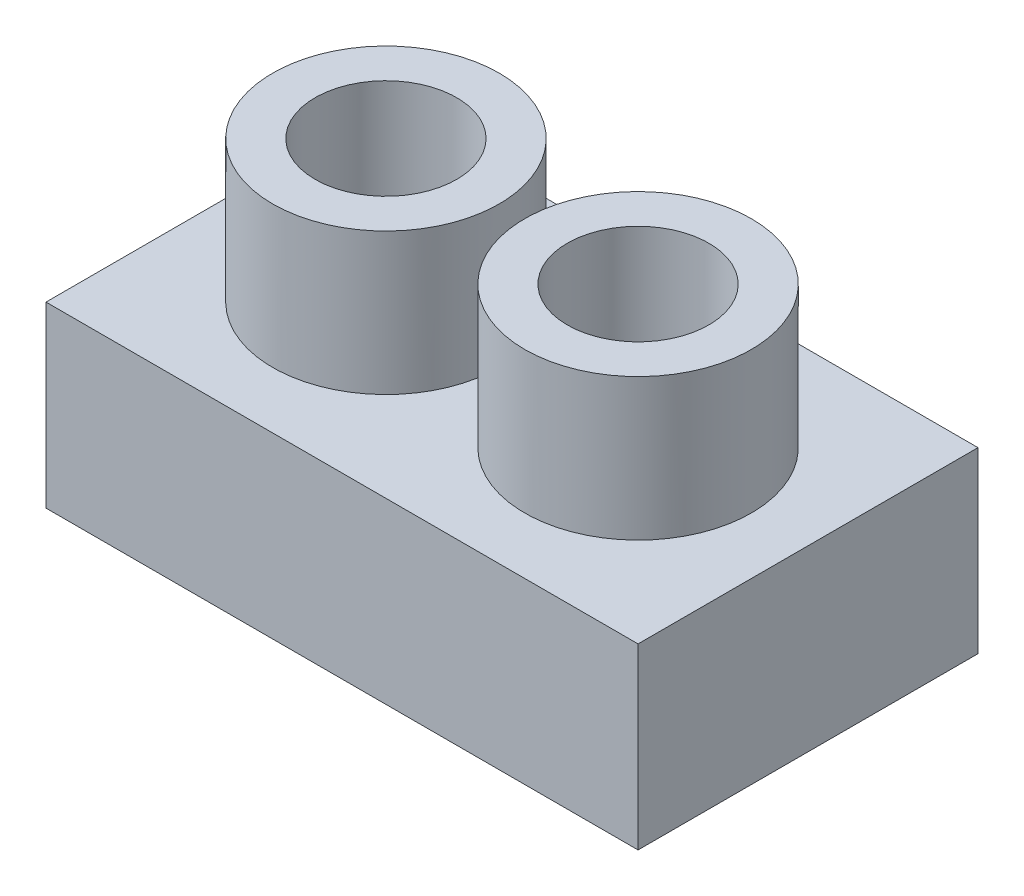
ISO-10303-21;
HEADER;
FILE_DESCRIPTION(('STEP AP214'),'2;1');
FILE_NAME('part.step','',(''),(''),'','','');
FILE_SCHEMA(('AUTOMOTIVE_DESIGN { 1 0 10303 214 1 1 1 1 }'));
ENDSEC;
DATA;
#1=APPLICATION_CONTEXT('core data for automotive mechanical design processes');
#2=APPLICATION_PROTOCOL_DEFINITION('international standard','automotive_design',2000,#1);
#3=PRODUCT_CONTEXT('',#1,'mechanical');
#4=PRODUCT('Part','Part','',(#3));
#5=PRODUCT_RELATED_PRODUCT_CATEGORY('part','',(#4));
#6=PRODUCT_DEFINITION_FORMATION('','',#4);
#7=PRODUCT_DEFINITION_CONTEXT('part definition',#1,'design');
#8=PRODUCT_DEFINITION('design','',#6,#7);
#9=PRODUCT_DEFINITION_SHAPE('','',#8);
#10=(LENGTH_UNIT() NAMED_UNIT(*) SI_UNIT(.MILLI.,.METRE.));
#11=(NAMED_UNIT(*) PLANE_ANGLE_UNIT() SI_UNIT($,.RADIAN.));
#12=(NAMED_UNIT(*) SI_UNIT($,.STERADIAN.) SOLID_ANGLE_UNIT());
#13=UNCERTAINTY_MEASURE_WITH_UNIT(LENGTH_MEASURE(1.E-05),#10,'distance_accuracy_value','');
#14=(GEOMETRIC_REPRESENTATION_CONTEXT(3) GLOBAL_UNCERTAINTY_ASSIGNED_CONTEXT((#13)) GLOBAL_UNIT_ASSIGNED_CONTEXT((#10,
#11,#12)) REPRESENTATION_CONTEXT('',''));
#15=CARTESIAN_POINT('',(0.,0.,0.));
#16=DIRECTION('',(0.,0.,1.));
#17=DIRECTION('',(1.,0.,0.));
#18=AXIS2_PLACEMENT_3D('',#15,#16,#17);
#19=CARTESIAN_POINT('',(0.,6.3,0.));
#20=DIRECTION('',(0.,-1.,0.));
#21=DIRECTION('',(0.,0.,-1.));
#22=AXIS2_PLACEMENT_3D('',#19,#20,#21);
#23=PLANE('',#22);
#24=CARTESIAN_POINT('',(-4.45,6.3,0.));
#25=DIRECTION('',(0.,-1.,0.));
#26=DIRECTION('',(0.,0.,-1.));
#27=AXIS2_PLACEMENT_3D('',#24,#25,#26);
#28=CIRCLE('',#27,4.);
#29=CARTESIAN_POINT('',(-4.45,6.3,-4.));
#30=VERTEX_POINT('',#29);
#31=EDGE_CURVE('E44',#30,#30,#28,.F.);
#32=ORIENTED_EDGE('',*,*,#31,.F.);
#33=EDGE_LOOP('',(#32));
#34=FACE_BOUND('',#33,.T.);
#35=DIRECTION('',(0.,0.,-1.));
#36=VECTOR('',#35,1.);
#37=CARTESIAN_POINT('',(10.45,6.3,6.));
#38=LINE('',#37,#36);
#39=CARTESIAN_POINT('',(10.45,6.3,6.));
#40=VERTEX_POINT('',#39);
#41=CARTESIAN_POINT('',(10.45,6.3,-6.));
#42=VERTEX_POINT('',#41);
#43=EDGE_CURVE('E88',#40,#42,#38,.T.);
#44=ORIENTED_EDGE('',*,*,#43,.T.);
#45=DIRECTION('',(-1.,0.,0.));
#46=VECTOR('',#45,1.);
#47=CARTESIAN_POINT('',(-10.45,6.3,-6.));
#48=LINE('',#47,#46);
#49=CARTESIAN_POINT('',(-10.45,6.3,-6.));
#50=VERTEX_POINT('',#49);
#51=EDGE_CURVE('E83',#42,#50,#48,.T.);
#52=ORIENTED_EDGE('',*,*,#51,.T.);
#53=DIRECTION('',(0.,0.,1.));
#54=VECTOR('',#53,1.);
#55=CARTESIAN_POINT('',(-10.45,6.3,6.));
#56=LINE('',#55,#54);
#57=CARTESIAN_POINT('',(-10.45,6.3,6.));
#58=VERTEX_POINT('',#57);
#59=EDGE_CURVE('E86',#50,#58,#56,.T.);
#60=ORIENTED_EDGE('',*,*,#59,.T.);
#61=DIRECTION('',(1.,0.,0.));
#62=VECTOR('',#61,1.);
#63=CARTESIAN_POINT('',(-10.45,6.3,6.));
#64=LINE('',#63,#62);
#65=EDGE_CURVE('E52',#58,#40,#64,.T.);
#66=ORIENTED_EDGE('',*,*,#65,.T.);
#67=EDGE_LOOP('',(#44,#52,#60,#66));
#68=FACE_BOUND('',#67,.T.);
#69=CARTESIAN_POINT('',(4.45,6.3,0.));
#70=DIRECTION('',(0.,-1.,0.));
#71=DIRECTION('',(0.,0.,-1.));
#72=AXIS2_PLACEMENT_3D('',#69,#70,#71);
#73=CIRCLE('',#72,4.);
#74=CARTESIAN_POINT('',(4.45,6.3,-4.));
#75=VERTEX_POINT('',#74);
#76=EDGE_CURVE('E11',#75,#75,#73,.F.);
#77=ORIENTED_EDGE('',*,*,#76,.F.);
#78=EDGE_LOOP('',(#77));
#79=FACE_BOUND('',#78,.T.);
#80=ADVANCED_FACE('F35',(#34,#68,#79),#23,.F.);
#81=CARTESIAN_POINT('',(10.45,6.3,6.));
#82=DIRECTION('',(-1.,0.,0.));
#83=DIRECTION('',(0.,0.,1.));
#84=AXIS2_PLACEMENT_3D('',#81,#82,#83);
#85=PLANE('',#84);
#86=DIRECTION('',(0.,0.,-1.));
#87=VECTOR('',#86,1.);
#88=CARTESIAN_POINT('',(10.45,0.,6.));
#89=LINE('',#88,#87);
#90=CARTESIAN_POINT('',(10.45,0.,6.));
#91=VERTEX_POINT('',#90);
#92=CARTESIAN_POINT('',(10.45,0.,-6.));
#93=VERTEX_POINT('',#92);
#94=EDGE_CURVE('E103',#91,#93,#89,.T.);
#95=ORIENTED_EDGE('',*,*,#94,.T.);
#96=DIRECTION('',(0.,-1.,0.));
#97=VECTOR('',#96,1.);
#98=CARTESIAN_POINT('',(10.45,6.3,-6.));
#99=LINE('',#98,#97);
#100=EDGE_CURVE('E94',#42,#93,#99,.T.);
#101=ORIENTED_EDGE('',*,*,#100,.F.);
#102=ORIENTED_EDGE('',*,*,#43,.F.);
#103=DIRECTION('',(0.,-1.,0.));
#104=VECTOR('',#103,1.);
#105=CARTESIAN_POINT('',(10.45,6.3,6.));
#106=LINE('',#105,#104);
#107=EDGE_CURVE('E99',#40,#91,#106,.T.);
#108=ORIENTED_EDGE('',*,*,#107,.T.);
#109=EDGE_LOOP('',(#95,#101,#102,#108));
#110=FACE_BOUND('',#109,.T.);
#111=ADVANCED_FACE('F37',(#110),#85,.F.);
#112=CARTESIAN_POINT('',(-10.45,6.3,-6.));
#113=DIRECTION('',(0.,0.,1.));
#114=DIRECTION('',(1.,0.,0.));
#115=AXIS2_PLACEMENT_3D('',#112,#113,#114);
#116=PLANE('',#115);
#117=DIRECTION('',(-1.,0.,0.));
#118=VECTOR('',#117,1.);
#119=CARTESIAN_POINT('',(-10.45,0.,-6.));
#120=LINE('',#119,#118);
#121=CARTESIAN_POINT('',(-10.45,0.,-6.));
#122=VERTEX_POINT('',#121);
#123=EDGE_CURVE('E93',#93,#122,#120,.T.);
#124=ORIENTED_EDGE('',*,*,#123,.T.);
#125=DIRECTION('',(0.,-1.,0.));
#126=VECTOR('',#125,1.);
#127=CARTESIAN_POINT('',(-10.45,6.3,-6.));
#128=LINE('',#127,#126);
#129=EDGE_CURVE('E91',#50,#122,#128,.T.);
#130=ORIENTED_EDGE('',*,*,#129,.F.);
#131=ORIENTED_EDGE('',*,*,#51,.F.);
#132=ORIENTED_EDGE('',*,*,#100,.T.);
#133=EDGE_LOOP('',(#124,#130,#131,#132));
#134=FACE_BOUND('',#133,.T.);
#135=ADVANCED_FACE('F92',(#134),#116,.F.);
#136=CARTESIAN_POINT('',(-10.45,6.3,6.));
#137=DIRECTION('',(1.,0.,0.));
#138=DIRECTION('',(0.,0.,-1.));
#139=AXIS2_PLACEMENT_3D('',#136,#137,#138);
#140=PLANE('',#139);
#141=DIRECTION('',(0.,0.,1.));
#142=VECTOR('',#141,1.);
#143=CARTESIAN_POINT('',(-10.45,0.,6.));
#144=LINE('',#143,#142);
#145=CARTESIAN_POINT('',(-10.45,0.,6.));
#146=VERTEX_POINT('',#145);
#147=EDGE_CURVE('E69',#122,#146,#144,.T.);
#148=ORIENTED_EDGE('',*,*,#147,.T.);
#149=DIRECTION('',(0.,-1.,0.));
#150=VECTOR('',#149,1.);
#151=CARTESIAN_POINT('',(-10.45,6.3,6.));
#152=LINE('',#151,#150);
#153=EDGE_CURVE('E95',#58,#146,#152,.T.);
#154=ORIENTED_EDGE('',*,*,#153,.F.);
#155=ORIENTED_EDGE('',*,*,#59,.F.);
#156=ORIENTED_EDGE('',*,*,#129,.T.);
#157=EDGE_LOOP('',(#148,#154,#155,#156));
#158=FACE_BOUND('',#157,.T.);
#159=ADVANCED_FACE('F97',(#158),#140,.F.);
#160=CARTESIAN_POINT('',(-10.45,6.3,6.));
#161=DIRECTION('',(0.,0.,-1.));
#162=DIRECTION('',(-1.,0.,0.));
#163=AXIS2_PLACEMENT_3D('',#160,#161,#162);
#164=PLANE('',#163);
#165=DIRECTION('',(1.,0.,0.));
#166=VECTOR('',#165,1.);
#167=CARTESIAN_POINT('',(-10.45,0.,6.));
#168=LINE('',#167,#166);
#169=EDGE_CURVE('E75',#146,#91,#168,.T.);
#170=ORIENTED_EDGE('',*,*,#169,.T.);
#171=ORIENTED_EDGE('',*,*,#107,.F.);
#172=ORIENTED_EDGE('',*,*,#65,.F.);
#173=ORIENTED_EDGE('',*,*,#153,.T.);
#174=EDGE_LOOP('',(#170,#171,#172,#173));
#175=FACE_BOUND('',#174,.T.);
#176=ADVANCED_FACE('F129',(#175),#164,.F.);
#177=CARTESIAN_POINT('',(0.,0.,0.));
#178=DIRECTION('',(0.,-1.,0.));
#179=DIRECTION('',(0.,0.,-1.));
#180=AXIS2_PLACEMENT_3D('',#177,#178,#179);
#181=PLANE('',#180);
#182=CARTESIAN_POINT('',(4.45,0.,0.));
#183=DIRECTION('',(0.,-1.,0.));
#184=DIRECTION('',(0.,0.,-1.));
#185=AXIS2_PLACEMENT_3D('',#182,#183,#184);
#186=CIRCLE('',#185,2.5);
#187=CARTESIAN_POINT('',(4.45,0.,-2.5));
#188=VERTEX_POINT('',#187);
#189=EDGE_CURVE('E232',#188,#188,#186,.F.);
#190=ORIENTED_EDGE('',*,*,#189,.T.);
#191=EDGE_LOOP('',(#190));
#192=FACE_BOUND('',#191,.T.);
#193=CARTESIAN_POINT('',(-4.45,0.,0.));
#194=DIRECTION('',(0.,-1.,0.));
#195=DIRECTION('',(0.,0.,-1.));
#196=AXIS2_PLACEMENT_3D('',#193,#194,#195);
#197=CIRCLE('',#196,2.5);
#198=CARTESIAN_POINT('',(-4.45,0.,-2.5));
#199=VERTEX_POINT('',#198);
#200=EDGE_CURVE('E236',#199,#199,#197,.F.);
#201=ORIENTED_EDGE('',*,*,#200,.T.);
#202=EDGE_LOOP('',(#201));
#203=FACE_BOUND('',#202,.T.);
#204=ORIENTED_EDGE('',*,*,#94,.F.);
#205=ORIENTED_EDGE('',*,*,#169,.F.);
#206=ORIENTED_EDGE('',*,*,#147,.F.);
#207=ORIENTED_EDGE('',*,*,#123,.F.);
#208=EDGE_LOOP('',(#204,#205,#206,#207));
#209=FACE_BOUND('',#208,.T.);
#210=ADVANCED_FACE('F126',(#192,#203,#209),#181,.T.);
#211=CARTESIAN_POINT('',(-4.45,11.3,0.));
#212=DIRECTION('',(0.,-1.,0.));
#213=DIRECTION('',(0.,0.,-1.));
#214=AXIS2_PLACEMENT_3D('',#211,#212,#213);
#215=CYLINDRICAL_SURFACE('',#214,4.);
#216=CARTESIAN_POINT('',(-4.45,11.3,0.));
#217=DIRECTION('',(0.,1.,0.));
#218=DIRECTION('',(0.,0.,1.));
#219=AXIS2_PLACEMENT_3D('',#216,#217,#218);
#220=CIRCLE('',#219,4.);
#221=CARTESIAN_POINT('',(-4.45,11.3,4.));
#222=VERTEX_POINT('',#221);
#223=EDGE_CURVE('E106',#222,#222,#220,.T.);
#224=ORIENTED_EDGE('',*,*,#223,.F.);
#225=EDGE_LOOP('',(#224));
#226=FACE_BOUND('',#225,.T.);
#227=ORIENTED_EDGE('',*,*,#31,.T.);
#228=EDGE_LOOP('',(#227));
#229=FACE_BOUND('',#228,.T.);
#230=ADVANCED_FACE('F115',(#226,#229),#215,.T.);
#231=CARTESIAN_POINT('',(-4.45,11.3,0.));
#232=DIRECTION('',(0.,1.,0.));
#233=DIRECTION('',(0.,0.,1.));
#234=AXIS2_PLACEMENT_3D('',#231,#232,#233);
#235=PLANE('',#234);
#236=CARTESIAN_POINT('',(-4.45,11.3,0.));
#237=DIRECTION('',(0.,1.,0.));
#238=DIRECTION('',(0.,0.,1.));
#239=AXIS2_PLACEMENT_3D('',#236,#237,#238);
#240=CIRCLE('',#239,2.5);
#241=CARTESIAN_POINT('',(-4.45,11.3,2.5));
#242=VERTEX_POINT('',#241);
#243=EDGE_CURVE('E233',#242,#242,#240,.T.);
#244=ORIENTED_EDGE('',*,*,#243,.F.);
#245=EDGE_LOOP('',(#244));
#246=FACE_BOUND('',#245,.T.);
#247=ORIENTED_EDGE('',*,*,#223,.T.);
#248=EDGE_LOOP('',(#247));
#249=FACE_BOUND('',#248,.T.);
#250=ADVANCED_FACE('F159',(#246,#249),#235,.T.);
#251=CARTESIAN_POINT('',(4.45,11.3,0.));
#252=DIRECTION('',(0.,-1.,0.));
#253=DIRECTION('',(0.,0.,-1.));
#254=AXIS2_PLACEMENT_3D('',#251,#252,#253);
#255=CYLINDRICAL_SURFACE('',#254,4.);
#256=CARTESIAN_POINT('',(4.45,11.3,0.));
#257=DIRECTION('',(0.,1.,0.));
#258=DIRECTION('',(0.,0.,1.));
#259=AXIS2_PLACEMENT_3D('',#256,#257,#258);
#260=CIRCLE('',#259,4.);
#261=CARTESIAN_POINT('',(4.45,11.3,4.));
#262=VERTEX_POINT('',#261);
#263=EDGE_CURVE('E242',#262,#262,#260,.T.);
#264=ORIENTED_EDGE('',*,*,#263,.F.);
#265=EDGE_LOOP('',(#264));
#266=FACE_BOUND('',#265,.T.);
#267=ORIENTED_EDGE('',*,*,#76,.T.);
#268=EDGE_LOOP('',(#267));
#269=FACE_BOUND('',#268,.T.);
#270=ADVANCED_FACE('F165',(#266,#269),#255,.T.);
#271=CARTESIAN_POINT('',(4.45,11.3,0.));
#272=DIRECTION('',(0.,1.,0.));
#273=DIRECTION('',(0.,0.,1.));
#274=AXIS2_PLACEMENT_3D('',#271,#272,#273);
#275=PLANE('',#274);
#276=CARTESIAN_POINT('',(4.45,11.3,0.));
#277=DIRECTION('',(0.,1.,0.));
#278=DIRECTION('',(0.,0.,1.));
#279=AXIS2_PLACEMENT_3D('',#276,#277,#278);
#280=CIRCLE('',#279,2.5);
#281=CARTESIAN_POINT('',(4.45,11.3,2.5));
#282=VERTEX_POINT('',#281);
#283=EDGE_CURVE('E229',#282,#282,#280,.T.);
#284=ORIENTED_EDGE('',*,*,#283,.F.);
#285=EDGE_LOOP('',(#284));
#286=FACE_BOUND('',#285,.T.);
#287=ORIENTED_EDGE('',*,*,#263,.T.);
#288=EDGE_LOOP('',(#287));
#289=FACE_BOUND('',#288,.T.);
#290=ADVANCED_FACE('F172',(#286,#289),#275,.T.);
#291=CARTESIAN_POINT('',(-4.45,-7.07106781186548,0.));
#292=DIRECTION('',(0.,1.,0.));
#293=DIRECTION('',(0.,0.,1.));
#294=AXIS2_PLACEMENT_3D('',#291,#292,#293);
#295=CYLINDRICAL_SURFACE('',#294,2.5);
#296=ORIENTED_EDGE('',*,*,#243,.T.);
#297=EDGE_LOOP('',(#296));
#298=FACE_BOUND('',#297,.T.);
#299=ORIENTED_EDGE('',*,*,#200,.F.);
#300=EDGE_LOOP('',(#299));
#301=FACE_BOUND('',#300,.T.);
#302=ADVANCED_FACE('F179',(#298,#301),#295,.F.);
#303=CARTESIAN_POINT('',(4.45,-7.07106781186548,0.));
#304=DIRECTION('',(0.,1.,0.));
#305=DIRECTION('',(0.,0.,1.));
#306=AXIS2_PLACEMENT_3D('',#303,#304,#305);
#307=CYLINDRICAL_SURFACE('',#306,2.5);
#308=ORIENTED_EDGE('',*,*,#283,.T.);
#309=EDGE_LOOP('',(#308));
#310=FACE_BOUND('',#309,.T.);
#311=ORIENTED_EDGE('',*,*,#189,.F.);
#312=EDGE_LOOP('',(#311));
#313=FACE_BOUND('',#312,.T.);
#314=ADVANCED_FACE('F187',(#310,#313),#307,.F.);
#315=CLOSED_SHELL('',(#80,#111,#135,#159,#176,#210,#230,#250,#270,#290,#302,#314));
#316=MANIFOLD_SOLID_BREP('B2',#315);
#317=ADVANCED_BREP_SHAPE_REPRESENTATION('',(#18,#316),#14);
#318=SHAPE_DEFINITION_REPRESENTATION(#9,#317);
ENDSEC;
END-ISO-10303-21;
